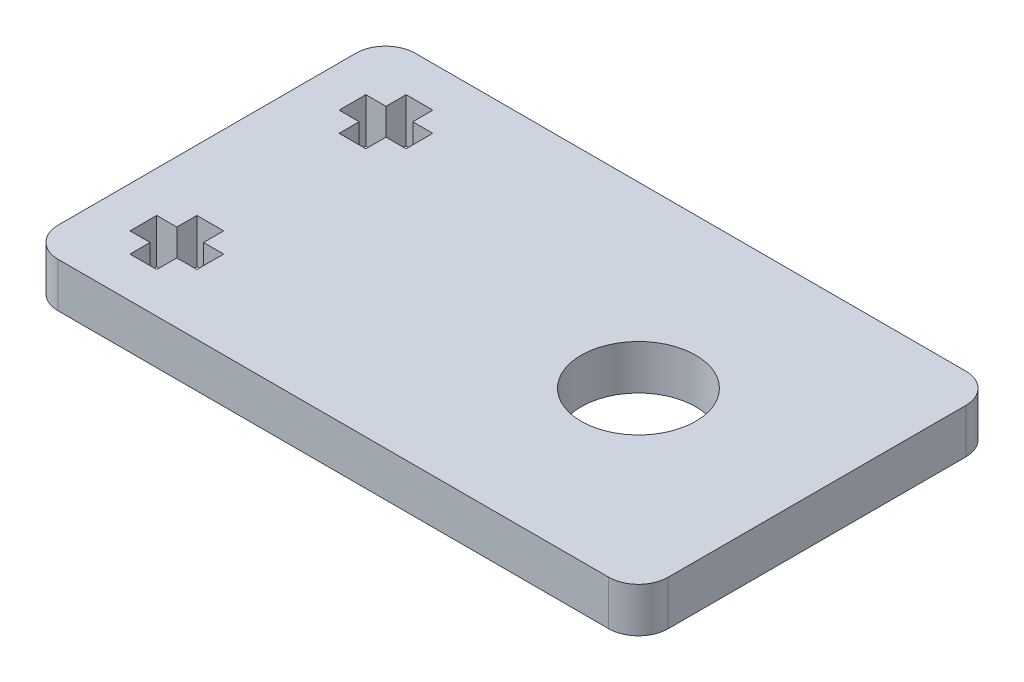
ISO-10303-21;
HEADER;
FILE_DESCRIPTION(('STEP AP214'),'2;1');
FILE_NAME('part.step','',(''),(''),'','','');
FILE_SCHEMA(('AUTOMOTIVE_DESIGN { 1 0 10303 214 1 1 1 1 }'));
ENDSEC;
DATA;
#1=APPLICATION_CONTEXT('core data for automotive mechanical design processes');
#2=APPLICATION_PROTOCOL_DEFINITION('international standard','automotive_design',2000,#1);
#3=PRODUCT_CONTEXT('',#1,'mechanical');
#4=PRODUCT('Part','Part','',(#3));
#5=PRODUCT_RELATED_PRODUCT_CATEGORY('part','',(#4));
#6=PRODUCT_DEFINITION_FORMATION('','',#4);
#7=PRODUCT_DEFINITION_CONTEXT('part definition',#1,'design');
#8=PRODUCT_DEFINITION('design','',#6,#7);
#9=PRODUCT_DEFINITION_SHAPE('','',#8);
#10=(LENGTH_UNIT() NAMED_UNIT(*) SI_UNIT(.MILLI.,.METRE.));
#11=(NAMED_UNIT(*) PLANE_ANGLE_UNIT() SI_UNIT($,.RADIAN.));
#12=(NAMED_UNIT(*) SI_UNIT($,.STERADIAN.) SOLID_ANGLE_UNIT());
#13=UNCERTAINTY_MEASURE_WITH_UNIT(LENGTH_MEASURE(1.E-05),#10,'distance_accuracy_value','');
#14=(GEOMETRIC_REPRESENTATION_CONTEXT(3) GLOBAL_UNCERTAINTY_ASSIGNED_CONTEXT((#13)) GLOBAL_UNIT_ASSIGNED_CONTEXT((#10,
#11,#12)) REPRESENTATION_CONTEXT('',''));
#15=CARTESIAN_POINT('',(0.,0.,0.));
#16=DIRECTION('',(0.,0.,1.));
#17=DIRECTION('',(1.,0.,0.));
#18=AXIS2_PLACEMENT_3D('',#15,#16,#17);
#19=CARTESIAN_POINT('',(0.,3.,0.));
#20=DIRECTION('',(0.,-1.,0.));
#21=DIRECTION('',(0.,0.,-1.));
#22=AXIS2_PLACEMENT_3D('',#19,#20,#21);
#23=PLANE('',#22);
#24=DIRECTION('',(0.,0.,-1.));
#25=VECTOR('',#24,1.);
#26=CARTESIAN_POINT('',(-21.75,3.,7.92943725152289));
#27=LINE('',#26,#25);
#28=CARTESIAN_POINT('',(-21.75,3.,7.92943725152289));
#29=VERTEX_POINT('',#28);
#30=CARTESIAN_POINT('',(-21.75,3.,6.12943725152289));
#31=VERTEX_POINT('',#30);
#32=EDGE_CURVE('E348',#29,#31,#27,.T.);
#33=ORIENTED_EDGE('',*,*,#32,.F.);
#34=DIRECTION('',(1.,0.,0.));
#35=VECTOR('',#34,1.);
#36=CARTESIAN_POINT('',(-23.1,3.,7.92943725152289));
#37=LINE('',#36,#35);
#38=CARTESIAN_POINT('',(-23.1,3.,7.92943725152289));
#39=VERTEX_POINT('',#38);
#40=EDGE_CURVE('E372',#39,#29,#37,.T.);
#41=ORIENTED_EDGE('',*,*,#40,.F.);
#42=DIRECTION('',(0.,0.,-1.));
#43=VECTOR('',#42,1.);
#44=CARTESIAN_POINT('',(-23.1,3.,9.27943725152289));
#45=LINE('',#44,#43);
#46=CARTESIAN_POINT('',(-23.1,3.,9.27943725152289));
#47=VERTEX_POINT('',#46);
#48=EDGE_CURVE('E369',#47,#39,#45,.T.);
#49=ORIENTED_EDGE('',*,*,#48,.F.);
#50=DIRECTION('',(1.,0.,0.));
#51=VECTOR('',#50,1.);
#52=CARTESIAN_POINT('',(-24.9,3.,9.27943725152289));
#53=LINE('',#52,#51);
#54=CARTESIAN_POINT('',(-24.9,3.,9.27943725152289));
#55=VERTEX_POINT('',#54);
#56=EDGE_CURVE('E367',#55,#47,#53,.T.);
#57=ORIENTED_EDGE('',*,*,#56,.F.);
#58=DIRECTION('',(0.,0.,1.));
#59=VECTOR('',#58,1.);
#60=CARTESIAN_POINT('',(-24.9,3.,7.92943725152289));
#61=LINE('',#60,#59);
#62=CARTESIAN_POINT('',(-24.9,3.,7.92943725152289));
#63=VERTEX_POINT('',#62);
#64=EDGE_CURVE('E365',#63,#55,#61,.T.);
#65=ORIENTED_EDGE('',*,*,#64,.F.);
#66=DIRECTION('',(1.,0.,0.));
#67=VECTOR('',#66,1.);
#68=CARTESIAN_POINT('',(-26.25,3.,7.92943725152289));
#69=LINE('',#68,#67);
#70=CARTESIAN_POINT('',(-26.25,3.,7.92943725152289));
#71=VERTEX_POINT('',#70);
#72=EDGE_CURVE('E363',#71,#63,#69,.T.);
#73=ORIENTED_EDGE('',*,*,#72,.F.);
#74=DIRECTION('',(0.,0.,1.));
#75=VECTOR('',#74,1.);
#76=CARTESIAN_POINT('',(-26.25,3.,6.12943725152289));
#77=LINE('',#76,#75);
#78=CARTESIAN_POINT('',(-26.25,3.,6.12943725152289));
#79=VERTEX_POINT('',#78);
#80=EDGE_CURVE('E361',#79,#71,#77,.T.);
#81=ORIENTED_EDGE('',*,*,#80,.F.);
#82=DIRECTION('',(-1.,0.,0.));
#83=VECTOR('',#82,1.);
#84=CARTESIAN_POINT('',(-24.9,3.,6.12943725152289));
#85=LINE('',#84,#83);
#86=CARTESIAN_POINT('',(-24.9,3.,6.12943725152289));
#87=VERTEX_POINT('',#86);
#88=EDGE_CURVE('E359',#87,#79,#85,.T.);
#89=ORIENTED_EDGE('',*,*,#88,.F.);
#90=DIRECTION('',(0.,0.,1.));
#91=VECTOR('',#90,1.);
#92=CARTESIAN_POINT('',(-24.9,3.,4.77943725152289));
#93=LINE('',#92,#91);
#94=CARTESIAN_POINT('',(-24.9,3.,4.77943725152289));
#95=VERTEX_POINT('',#94);
#96=EDGE_CURVE('E357',#95,#87,#93,.T.);
#97=ORIENTED_EDGE('',*,*,#96,.F.);
#98=DIRECTION('',(-1.,0.,0.));
#99=VECTOR('',#98,1.);
#100=CARTESIAN_POINT('',(-23.1,3.,4.77943725152289));
#101=LINE('',#100,#99);
#102=CARTESIAN_POINT('',(-23.1,3.,4.77943725152289));
#103=VERTEX_POINT('',#102);
#104=EDGE_CURVE('E355',#103,#95,#101,.T.);
#105=ORIENTED_EDGE('',*,*,#104,.F.);
#106=DIRECTION('',(0.,0.,-1.));
#107=VECTOR('',#106,1.);
#108=CARTESIAN_POINT('',(-23.1,3.,6.12943725152289));
#109=LINE('',#108,#107);
#110=CARTESIAN_POINT('',(-23.1,3.,6.12943725152289));
#111=VERTEX_POINT('',#110);
#112=EDGE_CURVE('E353',#111,#103,#109,.T.);
#113=ORIENTED_EDGE('',*,*,#112,.F.);
#114=DIRECTION('',(-1.,0.,0.));
#115=VECTOR('',#114,1.);
#116=CARTESIAN_POINT('',(-21.75,3.,6.12943725152289));
#117=LINE('',#116,#115);
#118=EDGE_CURVE('E350',#31,#111,#117,.T.);
#119=ORIENTED_EDGE('',*,*,#118,.F.);
#120=EDGE_LOOP('',(#33,#41,#49,#57,#65,#73,#81,#89,#97,#105,#113,#119));
#121=FACE_BOUND('',#120,.T.);
#122=DIRECTION('',(1.,0.,0.));
#123=VECTOR('',#122,1.);
#124=CARTESIAN_POINT('',(-29.,3.,12.));
#125=LINE('',#124,#123);
#126=CARTESIAN_POINT('',(-27.,3.,12.));
#127=VERTEX_POINT('',#126);
#128=CARTESIAN_POINT('',(9.99999999999999,3.,12.));
#129=VERTEX_POINT('',#128);
#130=EDGE_CURVE('E447',#127,#129,#125,.T.);
#131=ORIENTED_EDGE('',*,*,#130,.T.);
#132=CARTESIAN_POINT('',(10.,3.,10.));
#133=DIRECTION('',(0.,-1.,0.));
#134=DIRECTION('',(0.,0.,-1.));
#135=AXIS2_PLACEMENT_3D('',#132,#133,#134);
#136=CIRCLE('',#135,2.);
#137=CARTESIAN_POINT('',(12.,3.,10.));
#138=VERTEX_POINT('',#137);
#139=EDGE_CURVE('E481',#129,#138,#136,.F.);
#140=ORIENTED_EDGE('',*,*,#139,.T.);
#141=DIRECTION('',(0.,0.,1.));
#142=VECTOR('',#141,1.);
#143=CARTESIAN_POINT('',(12.,3.,21.6599183272156));
#144=LINE('',#143,#142);
#145=CARTESIAN_POINT('',(12.,3.,-10.));
#146=VERTEX_POINT('',#145);
#147=EDGE_CURVE('E503',#146,#138,#144,.T.);
#148=ORIENTED_EDGE('',*,*,#147,.F.);
#149=CARTESIAN_POINT('',(10.,3.,-10.));
#150=DIRECTION('',(0.,-1.,0.));
#151=DIRECTION('',(0.,0.,-1.));
#152=AXIS2_PLACEMENT_3D('',#149,#150,#151);
#153=CIRCLE('',#152,2.);
#154=CARTESIAN_POINT('',(9.99999999999999,3.,-12.));
#155=VERTEX_POINT('',#154);
#156=EDGE_CURVE('E479',#146,#155,#153,.F.);
#157=ORIENTED_EDGE('',*,*,#156,.T.);
#158=DIRECTION('',(-1.,0.,0.));
#159=VECTOR('',#158,1.);
#160=CARTESIAN_POINT('',(-29.,3.,-12.));
#161=LINE('',#160,#159);
#162=CARTESIAN_POINT('',(-27.,3.,-12.));
#163=VERTEX_POINT('',#162);
#164=EDGE_CURVE('E441',#155,#163,#161,.T.);
#165=ORIENTED_EDGE('',*,*,#164,.T.);
#166=CARTESIAN_POINT('',(-27.,3.,-10.));
#167=DIRECTION('',(0.,-1.,0.));
#168=DIRECTION('',(0.,0.,-1.));
#169=AXIS2_PLACEMENT_3D('',#166,#167,#168);
#170=CIRCLE('',#169,2.);
#171=CARTESIAN_POINT('',(-29.,3.,-10.));
#172=VERTEX_POINT('',#171);
#173=EDGE_CURVE('E464',#163,#172,#170,.F.);
#174=ORIENTED_EDGE('',*,*,#173,.T.);
#175=DIRECTION('',(0.,0.,1.));
#176=VECTOR('',#175,1.);
#177=CARTESIAN_POINT('',(-29.,3.,12.));
#178=LINE('',#177,#176);
#179=CARTESIAN_POINT('',(-29.,3.,10.));
#180=VERTEX_POINT('',#179);
#181=EDGE_CURVE('E443',#172,#180,#178,.T.);
#182=ORIENTED_EDGE('',*,*,#181,.T.);
#183=CARTESIAN_POINT('',(-27.,3.,10.));
#184=DIRECTION('',(0.,-1.,0.));
#185=DIRECTION('',(0.,0.,-1.));
#186=AXIS2_PLACEMENT_3D('',#183,#184,#185);
#187=CIRCLE('',#186,2.);
#188=EDGE_CURVE('E466',#180,#127,#187,.F.);
#189=ORIENTED_EDGE('',*,*,#188,.T.);
#190=EDGE_LOOP('',(#131,#140,#148,#157,#165,#174,#182,#189));
#191=FACE_BOUND('',#190,.T.);
#192=CARTESIAN_POINT('',(0.,3.,0.));
#193=DIRECTION('',(0.,1.,0.));
#194=DIRECTION('',(0.,0.,1.));
#195=AXIS2_PLACEMENT_3D('',#192,#193,#194);
#196=CIRCLE('',#195,3.85);
#197=CARTESIAN_POINT('',(0.,3.,3.85));
#198=VERTEX_POINT('',#197);
#199=EDGE_CURVE('E435',#198,#198,#196,.T.);
#200=ORIENTED_EDGE('',*,*,#199,.F.);
#201=EDGE_LOOP('',(#200));
#202=FACE_BOUND('',#201,.T.);
#203=DIRECTION('',(0.,0.,-1.));
#204=VECTOR('',#203,1.);
#205=CARTESIAN_POINT('',(-23.1,3.,-4.77943725152289));
#206=LINE('',#205,#204);
#207=CARTESIAN_POINT('',(-23.1,3.,-4.77943725152289));
#208=VERTEX_POINT('',#207);
#209=CARTESIAN_POINT('',(-23.1,3.,-6.12943725152289));
#210=VERTEX_POINT('',#209);
#211=EDGE_CURVE('E248',#208,#210,#206,.T.);
#212=ORIENTED_EDGE('',*,*,#211,.F.);
#213=DIRECTION('',(1.,0.,0.));
#214=VECTOR('',#213,1.);
#215=CARTESIAN_POINT('',(-24.9,3.,-4.77943725152289));
#216=LINE('',#215,#214);
#217=CARTESIAN_POINT('',(-24.9,3.,-4.77943725152289));
#218=VERTEX_POINT('',#217);
#219=EDGE_CURVE('E293',#218,#208,#216,.T.);
#220=ORIENTED_EDGE('',*,*,#219,.F.);
#221=DIRECTION('',(0.,0.,1.));
#222=VECTOR('',#221,1.);
#223=CARTESIAN_POINT('',(-24.9,3.,-6.12943725152289));
#224=LINE('',#223,#222);
#225=CARTESIAN_POINT('',(-24.9,3.,-6.12943725152289));
#226=VERTEX_POINT('',#225);
#227=EDGE_CURVE('E290',#226,#218,#224,.T.);
#228=ORIENTED_EDGE('',*,*,#227,.F.);
#229=DIRECTION('',(1.,0.,0.));
#230=VECTOR('',#229,1.);
#231=CARTESIAN_POINT('',(-26.25,3.,-6.12943725152289));
#232=LINE('',#231,#230);
#233=CARTESIAN_POINT('',(-26.25,3.,-6.12943725152289));
#234=VERTEX_POINT('',#233);
#235=EDGE_CURVE('E288',#234,#226,#232,.T.);
#236=ORIENTED_EDGE('',*,*,#235,.F.);
#237=DIRECTION('',(0.,0.,1.));
#238=VECTOR('',#237,1.);
#239=CARTESIAN_POINT('',(-26.25,3.,-7.92943725152289));
#240=LINE('',#239,#238);
#241=CARTESIAN_POINT('',(-26.25,3.,-7.92943725152289));
#242=VERTEX_POINT('',#241);
#243=EDGE_CURVE('E286',#242,#234,#240,.T.);
#244=ORIENTED_EDGE('',*,*,#243,.F.);
#245=DIRECTION('',(-1.,0.,0.));
#246=VECTOR('',#245,1.);
#247=CARTESIAN_POINT('',(-24.9,3.,-7.92943725152289));
#248=LINE('',#247,#246);
#249=CARTESIAN_POINT('',(-24.9,3.,-7.92943725152289));
#250=VERTEX_POINT('',#249);
#251=EDGE_CURVE('E284',#250,#242,#248,.T.);
#252=ORIENTED_EDGE('',*,*,#251,.F.);
#253=DIRECTION('',(0.,0.,1.));
#254=VECTOR('',#253,1.);
#255=CARTESIAN_POINT('',(-24.9,3.,-9.27943725152289));
#256=LINE('',#255,#254);
#257=CARTESIAN_POINT('',(-24.9,3.,-9.27943725152289));
#258=VERTEX_POINT('',#257);
#259=EDGE_CURVE('E282',#258,#250,#256,.T.);
#260=ORIENTED_EDGE('',*,*,#259,.F.);
#261=DIRECTION('',(-1.,0.,0.));
#262=VECTOR('',#261,1.);
#263=CARTESIAN_POINT('',(-23.1,3.,-9.27943725152289));
#264=LINE('',#263,#262);
#265=CARTESIAN_POINT('',(-23.1,3.,-9.27943725152289));
#266=VERTEX_POINT('',#265);
#267=EDGE_CURVE('E280',#266,#258,#264,.T.);
#268=ORIENTED_EDGE('',*,*,#267,.F.);
#269=DIRECTION('',(0.,0.,-1.));
#270=VECTOR('',#269,1.);
#271=CARTESIAN_POINT('',(-23.1,3.,-7.92943725152289));
#272=LINE('',#271,#270);
#273=CARTESIAN_POINT('',(-23.1,3.,-7.92943725152289));
#274=VERTEX_POINT('',#273);
#275=EDGE_CURVE('E278',#274,#266,#272,.T.);
#276=ORIENTED_EDGE('',*,*,#275,.F.);
#277=DIRECTION('',(-1.,0.,0.));
#278=VECTOR('',#277,1.);
#279=CARTESIAN_POINT('',(-21.75,3.,-7.92943725152289));
#280=LINE('',#279,#278);
#281=CARTESIAN_POINT('',(-21.75,3.,-7.92943725152289));
#282=VERTEX_POINT('',#281);
#283=EDGE_CURVE('E273',#282,#274,#280,.T.);
#284=ORIENTED_EDGE('',*,*,#283,.F.);
#285=DIRECTION('',(0.,0.,-1.));
#286=VECTOR('',#285,1.);
#287=CARTESIAN_POINT('',(-21.75,3.,-6.12943725152289));
#288=LINE('',#287,#286);
#289=CARTESIAN_POINT('',(-21.75,3.,-6.12943725152289));
#290=VERTEX_POINT('',#289);
#291=EDGE_CURVE('E271',#290,#282,#288,.T.);
#292=ORIENTED_EDGE('',*,*,#291,.F.);
#293=DIRECTION('',(1.,0.,0.));
#294=VECTOR('',#293,1.);
#295=CARTESIAN_POINT('',(-23.1,3.,-6.12943725152289));
#296=LINE('',#295,#294);
#297=EDGE_CURVE('E258',#210,#290,#296,.T.);
#298=ORIENTED_EDGE('',*,*,#297,.F.);
#299=EDGE_LOOP('',(#212,#220,#228,#236,#244,#252,#260,#268,#276,#284,#292,#298));
#300=FACE_BOUND('',#299,.T.);
#301=ADVANCED_FACE('F38',(#121,#191,#202,#300),#23,.F.);
#302=CARTESIAN_POINT('',(0.,0.,0.));
#303=DIRECTION('',(0.,-1.,0.));
#304=DIRECTION('',(0.,0.,-1.));
#305=AXIS2_PLACEMENT_3D('',#302,#303,#304);
#306=PLANE('',#305);
#307=DIRECTION('',(0.,0.,-1.));
#308=VECTOR('',#307,1.);
#309=CARTESIAN_POINT('',(12.,0.,0.));
#310=LINE('',#309,#308);
#311=CARTESIAN_POINT('',(12.,0.,10.));
#312=VERTEX_POINT('',#311);
#313=CARTESIAN_POINT('',(12.,0.,-10.));
#314=VERTEX_POINT('',#313);
#315=EDGE_CURVE('E297',#312,#314,#310,.T.);
#316=ORIENTED_EDGE('',*,*,#315,.F.);
#317=CARTESIAN_POINT('',(10.,0.,10.));
#318=DIRECTION('',(0.,-1.,0.));
#319=DIRECTION('',(0.,0.,-1.));
#320=AXIS2_PLACEMENT_3D('',#317,#318,#319);
#321=CIRCLE('',#320,2.);
#322=CARTESIAN_POINT('',(9.99999999999999,0.,12.));
#323=VERTEX_POINT('',#322);
#324=EDGE_CURVE('E46',#312,#323,#321,.T.);
#325=ORIENTED_EDGE('',*,*,#324,.T.);
#326=DIRECTION('',(1.,0.,0.));
#327=VECTOR('',#326,1.);
#328=CARTESIAN_POINT('',(-29.,0.,12.));
#329=LINE('',#328,#327);
#330=CARTESIAN_POINT('',(-27.,0.,12.));
#331=VERTEX_POINT('',#330);
#332=EDGE_CURVE('E444',#331,#323,#329,.T.);
#333=ORIENTED_EDGE('',*,*,#332,.F.);
#334=CARTESIAN_POINT('',(-27.,0.,10.));
#335=DIRECTION('',(0.,-1.,0.));
#336=DIRECTION('',(0.,0.,-1.));
#337=AXIS2_PLACEMENT_3D('',#334,#335,#336);
#338=CIRCLE('',#337,2.);
#339=CARTESIAN_POINT('',(-29.,0.,10.));
#340=VERTEX_POINT('',#339);
#341=EDGE_CURVE('E459',#331,#340,#338,.T.);
#342=ORIENTED_EDGE('',*,*,#341,.T.);
#343=DIRECTION('',(0.,0.,1.));
#344=VECTOR('',#343,1.);
#345=CARTESIAN_POINT('',(-29.,0.,12.));
#346=LINE('',#345,#344);
#347=CARTESIAN_POINT('',(-29.,0.,-10.));
#348=VERTEX_POINT('',#347);
#349=EDGE_CURVE('E452',#348,#340,#346,.T.);
#350=ORIENTED_EDGE('',*,*,#349,.F.);
#351=CARTESIAN_POINT('',(-27.,0.,-10.));
#352=DIRECTION('',(0.,-1.,0.));
#353=DIRECTION('',(0.,0.,-1.));
#354=AXIS2_PLACEMENT_3D('',#351,#352,#353);
#355=CIRCLE('',#354,2.);
#356=CARTESIAN_POINT('',(-27.,0.,-12.));
#357=VERTEX_POINT('',#356);
#358=EDGE_CURVE('E450',#348,#357,#355,.T.);
#359=ORIENTED_EDGE('',*,*,#358,.T.);
#360=DIRECTION('',(-1.,0.,0.));
#361=VECTOR('',#360,1.);
#362=CARTESIAN_POINT('',(-29.,0.,-12.));
#363=LINE('',#362,#361);
#364=CARTESIAN_POINT('',(9.99999999999999,0.,-12.));
#365=VERTEX_POINT('',#364);
#366=EDGE_CURVE('E438',#365,#357,#363,.T.);
#367=ORIENTED_EDGE('',*,*,#366,.F.);
#368=CARTESIAN_POINT('',(10.,0.,-10.));
#369=DIRECTION('',(0.,-1.,0.));
#370=DIRECTION('',(0.,0.,-1.));
#371=AXIS2_PLACEMENT_3D('',#368,#369,#370);
#372=CIRCLE('',#371,2.);
#373=EDGE_CURVE('E53',#365,#314,#372,.T.);
#374=ORIENTED_EDGE('',*,*,#373,.T.);
#375=EDGE_LOOP('',(#316,#325,#333,#342,#350,#359,#367,#374));
#376=FACE_BOUND('',#375,.T.);
#377=CARTESIAN_POINT('',(0.,0.,0.));
#378=DIRECTION('',(0.,1.,0.));
#379=DIRECTION('',(0.,0.,1.));
#380=AXIS2_PLACEMENT_3D('',#377,#378,#379);
#381=CIRCLE('',#380,3.85);
#382=CARTESIAN_POINT('',(0.,0.,3.85));
#383=VERTEX_POINT('',#382);
#384=EDGE_CURVE('E434',#383,#383,#381,.T.);
#385=ORIENTED_EDGE('',*,*,#384,.T.);
#386=EDGE_LOOP('',(#385));
#387=FACE_BOUND('',#386,.T.);
#388=DIRECTION('',(1.,0.,0.));
#389=VECTOR('',#388,1.);
#390=CARTESIAN_POINT('',(-23.1,0.,7.92943725152289));
#391=LINE('',#390,#389);
#392=CARTESIAN_POINT('',(-23.1,0.,7.92943725152289));
#393=VERTEX_POINT('',#392);
#394=CARTESIAN_POINT('',(-21.75,0.,7.92943725152289));
#395=VERTEX_POINT('',#394);
#396=EDGE_CURVE('E351',#393,#395,#391,.T.);
#397=ORIENTED_EDGE('',*,*,#396,.T.);
#398=DIRECTION('',(0.,0.,-1.));
#399=VECTOR('',#398,1.);
#400=CARTESIAN_POINT('',(-21.75,0.,7.92943725152289));
#401=LINE('',#400,#399);
#402=CARTESIAN_POINT('',(-21.75,0.,6.12943725152289));
#403=VERTEX_POINT('',#402);
#404=EDGE_CURVE('E266',#395,#403,#401,.T.);
#405=ORIENTED_EDGE('',*,*,#404,.T.);
#406=DIRECTION('',(-1.,0.,0.));
#407=VECTOR('',#406,1.);
#408=CARTESIAN_POINT('',(-21.75,0.,6.12943725152289));
#409=LINE('',#408,#407);
#410=CARTESIAN_POINT('',(-23.1,0.,6.12943725152289));
#411=VERTEX_POINT('',#410);
#412=EDGE_CURVE('E377',#403,#411,#409,.T.);
#413=ORIENTED_EDGE('',*,*,#412,.T.);
#414=DIRECTION('',(0.,0.,-1.));
#415=VECTOR('',#414,1.);
#416=CARTESIAN_POINT('',(-23.1,0.,6.12943725152289));
#417=LINE('',#416,#415);
#418=CARTESIAN_POINT('',(-23.1,0.,4.77943725152289));
#419=VERTEX_POINT('',#418);
#420=EDGE_CURVE('E380',#411,#419,#417,.T.);
#421=ORIENTED_EDGE('',*,*,#420,.T.);
#422=DIRECTION('',(-1.,0.,0.));
#423=VECTOR('',#422,1.);
#424=CARTESIAN_POINT('',(-23.1,0.,4.77943725152289));
#425=LINE('',#424,#423);
#426=CARTESIAN_POINT('',(-24.9,0.,4.77943725152289));
#427=VERTEX_POINT('',#426);
#428=EDGE_CURVE('E383',#419,#427,#425,.T.);
#429=ORIENTED_EDGE('',*,*,#428,.T.);
#430=DIRECTION('',(0.,0.,1.));
#431=VECTOR('',#430,1.);
#432=CARTESIAN_POINT('',(-24.9,0.,4.77943725152289));
#433=LINE('',#432,#431);
#434=CARTESIAN_POINT('',(-24.9,0.,6.12943725152289));
#435=VERTEX_POINT('',#434);
#436=EDGE_CURVE('E386',#427,#435,#433,.T.);
#437=ORIENTED_EDGE('',*,*,#436,.T.);
#438=DIRECTION('',(-1.,0.,0.));
#439=VECTOR('',#438,1.);
#440=CARTESIAN_POINT('',(-24.9,0.,6.12943725152289));
#441=LINE('',#440,#439);
#442=CARTESIAN_POINT('',(-26.25,0.,6.12943725152289));
#443=VERTEX_POINT('',#442);
#444=EDGE_CURVE('E389',#435,#443,#441,.T.);
#445=ORIENTED_EDGE('',*,*,#444,.T.);
#446=DIRECTION('',(0.,0.,1.));
#447=VECTOR('',#446,1.);
#448=CARTESIAN_POINT('',(-26.25,0.,6.12943725152289));
#449=LINE('',#448,#447);
#450=CARTESIAN_POINT('',(-26.25,0.,7.92943725152289));
#451=VERTEX_POINT('',#450);
#452=EDGE_CURVE('E392',#443,#451,#449,.T.);
#453=ORIENTED_EDGE('',*,*,#452,.T.);
#454=DIRECTION('',(1.,0.,0.));
#455=VECTOR('',#454,1.);
#456=CARTESIAN_POINT('',(-26.25,0.,7.92943725152289));
#457=LINE('',#456,#455);
#458=CARTESIAN_POINT('',(-24.9,0.,7.92943725152289));
#459=VERTEX_POINT('',#458);
#460=EDGE_CURVE('E395',#451,#459,#457,.T.);
#461=ORIENTED_EDGE('',*,*,#460,.T.);
#462=DIRECTION('',(0.,0.,1.));
#463=VECTOR('',#462,1.);
#464=CARTESIAN_POINT('',(-24.9,0.,7.92943725152289));
#465=LINE('',#464,#463);
#466=CARTESIAN_POINT('',(-24.9,0.,9.27943725152289));
#467=VERTEX_POINT('',#466);
#468=EDGE_CURVE('E398',#459,#467,#465,.T.);
#469=ORIENTED_EDGE('',*,*,#468,.T.);
#470=DIRECTION('',(1.,0.,0.));
#471=VECTOR('',#470,1.);
#472=CARTESIAN_POINT('',(-24.9,0.,9.27943725152289));
#473=LINE('',#472,#471);
#474=CARTESIAN_POINT('',(-23.1,0.,9.27943725152289));
#475=VERTEX_POINT('',#474);
#476=EDGE_CURVE('E401',#467,#475,#473,.T.);
#477=ORIENTED_EDGE('',*,*,#476,.T.);
#478=DIRECTION('',(0.,0.,-1.));
#479=VECTOR('',#478,1.);
#480=CARTESIAN_POINT('',(-23.1,0.,9.27943725152289));
#481=LINE('',#480,#479);
#482=EDGE_CURVE('E404',#475,#393,#481,.T.);
#483=ORIENTED_EDGE('',*,*,#482,.T.);
#484=EDGE_LOOP('',(#397,#405,#413,#421,#429,#437,#445,#453,#461,#469,#477,#483));
#485=FACE_BOUND('',#484,.T.);
#486=DIRECTION('',(1.,0.,0.));
#487=VECTOR('',#486,1.);
#488=CARTESIAN_POINT('',(-24.9,0.,-4.77943725152289));
#489=LINE('',#488,#487);
#490=CARTESIAN_POINT('',(-24.9,0.,-4.77943725152289));
#491=VERTEX_POINT('',#490);
#492=CARTESIAN_POINT('',(-23.1,0.,-4.77943725152289));
#493=VERTEX_POINT('',#492);
#494=EDGE_CURVE('E259',#491,#493,#489,.T.);
#495=ORIENTED_EDGE('',*,*,#494,.T.);
#496=DIRECTION('',(0.,0.,-1.));
#497=VECTOR('',#496,1.);
#498=CARTESIAN_POINT('',(-23.1,0.,-4.77943725152289));
#499=LINE('',#498,#497);
#500=CARTESIAN_POINT('',(-23.1,0.,-6.12943725152289));
#501=VERTEX_POINT('',#500);
#502=EDGE_CURVE('E295',#493,#501,#499,.T.);
#503=ORIENTED_EDGE('',*,*,#502,.T.);
#504=DIRECTION('',(1.,0.,0.));
#505=VECTOR('',#504,1.);
#506=CARTESIAN_POINT('',(-23.1,0.,-6.12943725152289));
#507=LINE('',#506,#505);
#508=CARTESIAN_POINT('',(-21.75,0.,-6.12943725152289));
#509=VERTEX_POINT('',#508);
#510=EDGE_CURVE('E265',#501,#509,#507,.T.);
#511=ORIENTED_EDGE('',*,*,#510,.T.);
#512=DIRECTION('',(0.,0.,-1.));
#513=VECTOR('',#512,1.);
#514=CARTESIAN_POINT('',(-21.75,0.,-6.12943725152289));
#515=LINE('',#514,#513);
#516=CARTESIAN_POINT('',(-21.75,0.,-7.92943725152289));
#517=VERTEX_POINT('',#516);
#518=EDGE_CURVE('E299',#509,#517,#515,.T.);
#519=ORIENTED_EDGE('',*,*,#518,.T.);
#520=DIRECTION('',(-1.,0.,0.));
#521=VECTOR('',#520,1.);
#522=CARTESIAN_POINT('',(-21.75,0.,-7.92943725152289));
#523=LINE('',#522,#521);
#524=CARTESIAN_POINT('',(-23.1,0.,-7.92943725152289));
#525=VERTEX_POINT('',#524);
#526=EDGE_CURVE('E302',#517,#525,#523,.T.);
#527=ORIENTED_EDGE('',*,*,#526,.T.);
#528=DIRECTION('',(0.,0.,-1.));
#529=VECTOR('',#528,1.);
#530=CARTESIAN_POINT('',(-23.1,0.,-7.92943725152289));
#531=LINE('',#530,#529);
#532=CARTESIAN_POINT('',(-23.1,0.,-9.27943725152289));
#533=VERTEX_POINT('',#532);
#534=EDGE_CURVE('E305',#525,#533,#531,.T.);
#535=ORIENTED_EDGE('',*,*,#534,.T.);
#536=DIRECTION('',(-1.,0.,0.));
#537=VECTOR('',#536,1.);
#538=CARTESIAN_POINT('',(-23.1,0.,-9.27943725152289));
#539=LINE('',#538,#537);
#540=CARTESIAN_POINT('',(-24.9,0.,-9.27943725152289));
#541=VERTEX_POINT('',#540);
#542=EDGE_CURVE('E308',#533,#541,#539,.T.);
#543=ORIENTED_EDGE('',*,*,#542,.T.);
#544=DIRECTION('',(0.,0.,1.));
#545=VECTOR('',#544,1.);
#546=CARTESIAN_POINT('',(-24.9,0.,-9.27943725152289));
#547=LINE('',#546,#545);
#548=CARTESIAN_POINT('',(-24.9,0.,-7.92943725152289));
#549=VERTEX_POINT('',#548);
#550=EDGE_CURVE('E311',#541,#549,#547,.T.);
#551=ORIENTED_EDGE('',*,*,#550,.T.);
#552=DIRECTION('',(-1.,0.,0.));
#553=VECTOR('',#552,1.);
#554=CARTESIAN_POINT('',(-24.9,0.,-7.92943725152289));
#555=LINE('',#554,#553);
#556=CARTESIAN_POINT('',(-26.25,0.,-7.92943725152289));
#557=VERTEX_POINT('',#556);
#558=EDGE_CURVE('E314',#549,#557,#555,.T.);
#559=ORIENTED_EDGE('',*,*,#558,.T.);
#560=DIRECTION('',(0.,0.,1.));
#561=VECTOR('',#560,1.);
#562=CARTESIAN_POINT('',(-26.25,0.,-7.92943725152289));
#563=LINE('',#562,#561);
#564=CARTESIAN_POINT('',(-26.25,0.,-6.12943725152289));
#565=VERTEX_POINT('',#564);
#566=EDGE_CURVE('E317',#557,#565,#563,.T.);
#567=ORIENTED_EDGE('',*,*,#566,.T.);
#568=DIRECTION('',(1.,0.,0.));
#569=VECTOR('',#568,1.);
#570=CARTESIAN_POINT('',(-26.25,0.,-6.12943725152289));
#571=LINE('',#570,#569);
#572=CARTESIAN_POINT('',(-24.9,0.,-6.12943725152289));
#573=VERTEX_POINT('',#572);
#574=EDGE_CURVE('E320',#565,#573,#571,.T.);
#575=ORIENTED_EDGE('',*,*,#574,.T.);
#576=DIRECTION('',(0.,0.,1.));
#577=VECTOR('',#576,1.);
#578=CARTESIAN_POINT('',(-24.9,0.,-6.12943725152289));
#579=LINE('',#578,#577);
#580=EDGE_CURVE('E323',#573,#491,#579,.T.);
#581=ORIENTED_EDGE('',*,*,#580,.T.);
#582=EDGE_LOOP('',(#495,#503,#511,#519,#527,#535,#543,#551,#559,#567,#575,#581));
#583=FACE_BOUND('',#582,.T.);
#584=ADVANCED_FACE('F489',(#376,#387,#485,#583),#306,.T.);
#585=CARTESIAN_POINT('',(-29.,3.,-12.));
#586=DIRECTION('',(0.,0.,1.));
#587=DIRECTION('',(1.,0.,0.));
#588=AXIS2_PLACEMENT_3D('',#585,#586,#587);
#589=PLANE('',#588);
#590=ORIENTED_EDGE('',*,*,#164,.F.);
#591=DIRECTION('',(0.,-1.,0.));
#592=VECTOR('',#591,1.);
#593=CARTESIAN_POINT('',(10.,3.,-12.));
#594=LINE('',#593,#592);
#595=EDGE_CURVE('E11',#155,#365,#594,.T.);
#596=ORIENTED_EDGE('',*,*,#595,.T.);
#597=ORIENTED_EDGE('',*,*,#366,.T.);
#598=DIRECTION('',(0.,-1.,0.));
#599=VECTOR('',#598,1.);
#600=CARTESIAN_POINT('',(-27.,3.,-12.));
#601=LINE('',#600,#599);
#602=EDGE_CURVE('E468',#357,#163,#601,.F.);
#603=ORIENTED_EDGE('',*,*,#602,.T.);
#604=EDGE_LOOP('',(#590,#596,#597,#603));
#605=FACE_BOUND('',#604,.T.);
#606=ADVANCED_FACE('F510',(#605),#589,.F.);
#607=CARTESIAN_POINT('',(-29.,3.,12.));
#608=DIRECTION('',(1.,0.,0.));
#609=DIRECTION('',(0.,0.,-1.));
#610=AXIS2_PLACEMENT_3D('',#607,#608,#609);
#611=PLANE('',#610);
#612=ORIENTED_EDGE('',*,*,#349,.T.);
#613=DIRECTION('',(0.,-1.,0.));
#614=VECTOR('',#613,1.);
#615=CARTESIAN_POINT('',(-29.,3.,10.));
#616=LINE('',#615,#614);
#617=EDGE_CURVE('E474',#340,#180,#616,.F.);
#618=ORIENTED_EDGE('',*,*,#617,.T.);
#619=ORIENTED_EDGE('',*,*,#181,.F.);
#620=DIRECTION('',(0.,-1.,0.));
#621=VECTOR('',#620,1.);
#622=CARTESIAN_POINT('',(-29.,3.,-10.));
#623=LINE('',#622,#621);
#624=EDGE_CURVE('E471',#172,#348,#623,.T.);
#625=ORIENTED_EDGE('',*,*,#624,.T.);
#626=EDGE_LOOP('',(#612,#618,#619,#625));
#627=FACE_BOUND('',#626,.T.);
#628=ADVANCED_FACE('F519',(#627),#611,.F.);
#629=CARTESIAN_POINT('',(-29.,3.,12.));
#630=DIRECTION('',(0.,0.,-1.));
#631=DIRECTION('',(-1.,0.,0.));
#632=AXIS2_PLACEMENT_3D('',#629,#630,#631);
#633=PLANE('',#632);
#634=ORIENTED_EDGE('',*,*,#332,.T.);
#635=DIRECTION('',(0.,1.,0.));
#636=VECTOR('',#635,1.);
#637=CARTESIAN_POINT('',(10.,3.,12.));
#638=LINE('',#637,#636);
#639=EDGE_CURVE('E476',#323,#129,#638,.T.);
#640=ORIENTED_EDGE('',*,*,#639,.T.);
#641=ORIENTED_EDGE('',*,*,#130,.F.);
#642=DIRECTION('',(0.,-1.,0.));
#643=VECTOR('',#642,1.);
#644=CARTESIAN_POINT('',(-27.,3.,12.));
#645=LINE('',#644,#643);
#646=EDGE_CURVE('E461',#127,#331,#645,.T.);
#647=ORIENTED_EDGE('',*,*,#646,.T.);
#648=EDGE_LOOP('',(#634,#640,#641,#647));
#649=FACE_BOUND('',#648,.T.);
#650=ADVANCED_FACE('F495',(#649),#633,.F.);
#651=CARTESIAN_POINT('',(0.,3.,0.));
#652=DIRECTION('',(0.,-1.,0.));
#653=DIRECTION('',(0.,0.,-1.));
#654=AXIS2_PLACEMENT_3D('',#651,#652,#653);
#655=CYLINDRICAL_SURFACE('',#654,3.85);
#656=ORIENTED_EDGE('',*,*,#199,.T.);
#657=EDGE_LOOP('',(#656));
#658=FACE_BOUND('',#657,.T.);
#659=ORIENTED_EDGE('',*,*,#384,.F.);
#660=EDGE_LOOP('',(#659));
#661=FACE_BOUND('',#660,.T.);
#662=ADVANCED_FACE('F546',(#658,#661),#655,.F.);
#663=CARTESIAN_POINT('',(-21.75,3.,7.92943725152289));
#664=DIRECTION('',(-1.,0.,0.));
#665=DIRECTION('',(0.,0.,1.));
#666=AXIS2_PLACEMENT_3D('',#663,#664,#665);
#667=PLANE('',#666);
#668=ORIENTED_EDGE('',*,*,#404,.F.);
#669=DIRECTION('',(0.,-1.,0.));
#670=VECTOR('',#669,1.);
#671=CARTESIAN_POINT('',(-21.75,3.,7.92943725152289));
#672=LINE('',#671,#670);
#673=EDGE_CURVE('E374',#29,#395,#672,.T.);
#674=ORIENTED_EDGE('',*,*,#673,.F.);
#675=ORIENTED_EDGE('',*,*,#32,.T.);
#676=DIRECTION('',(0.,-1.,0.));
#677=VECTOR('',#676,1.);
#678=CARTESIAN_POINT('',(-21.75,3.,6.12943725152289));
#679=LINE('',#678,#677);
#680=EDGE_CURVE('E431',#31,#403,#679,.T.);
#681=ORIENTED_EDGE('',*,*,#680,.T.);
#682=EDGE_LOOP('',(#668,#674,#675,#681));
#683=FACE_BOUND('',#682,.T.);
#684=ADVANCED_FACE('F792',(#683),#667,.T.);
#685=CARTESIAN_POINT('',(-21.75,3.,6.12943725152289));
#686=DIRECTION('',(0.,0.,1.));
#687=DIRECTION('',(1.,0.,0.));
#688=AXIS2_PLACEMENT_3D('',#685,#686,#687);
#689=PLANE('',#688);
#690=ORIENTED_EDGE('',*,*,#412,.F.);
#691=ORIENTED_EDGE('',*,*,#680,.F.);
#692=ORIENTED_EDGE('',*,*,#118,.T.);
#693=DIRECTION('',(0.,-1.,0.));
#694=VECTOR('',#693,1.);
#695=CARTESIAN_POINT('',(-23.1,3.,6.12943725152289));
#696=LINE('',#695,#694);
#697=EDGE_CURVE('E429',#111,#411,#696,.T.);
#698=ORIENTED_EDGE('',*,*,#697,.T.);
#699=EDGE_LOOP('',(#690,#691,#692,#698));
#700=FACE_BOUND('',#699,.T.);
#701=ADVANCED_FACE('F783',(#700),#689,.T.);
#702=CARTESIAN_POINT('',(-23.1,3.,6.12943725152289));
#703=DIRECTION('',(-1.,0.,0.));
#704=DIRECTION('',(0.,0.,1.));
#705=AXIS2_PLACEMENT_3D('',#702,#703,#704);
#706=PLANE('',#705);
#707=ORIENTED_EDGE('',*,*,#420,.F.);
#708=ORIENTED_EDGE('',*,*,#697,.F.);
#709=ORIENTED_EDGE('',*,*,#112,.T.);
#710=DIRECTION('',(0.,-1.,0.));
#711=VECTOR('',#710,1.);
#712=CARTESIAN_POINT('',(-23.1,3.,4.77943725152289));
#713=LINE('',#712,#711);
#714=EDGE_CURVE('E427',#103,#419,#713,.T.);
#715=ORIENTED_EDGE('',*,*,#714,.T.);
#716=EDGE_LOOP('',(#707,#708,#709,#715));
#717=FACE_BOUND('',#716,.T.);
#718=ADVANCED_FACE('F774',(#717),#706,.T.);
#719=CARTESIAN_POINT('',(-23.1,3.,4.77943725152289));
#720=DIRECTION('',(0.,0.,1.));
#721=DIRECTION('',(1.,0.,0.));
#722=AXIS2_PLACEMENT_3D('',#719,#720,#721);
#723=PLANE('',#722);
#724=ORIENTED_EDGE('',*,*,#428,.F.);
#725=ORIENTED_EDGE('',*,*,#714,.F.);
#726=ORIENTED_EDGE('',*,*,#104,.T.);
#727=DIRECTION('',(0.,-1.,0.));
#728=VECTOR('',#727,1.);
#729=CARTESIAN_POINT('',(-24.9,3.,4.77943725152289));
#730=LINE('',#729,#728);
#731=EDGE_CURVE('E425',#95,#427,#730,.T.);
#732=ORIENTED_EDGE('',*,*,#731,.T.);
#733=EDGE_LOOP('',(#724,#725,#726,#732));
#734=FACE_BOUND('',#733,.T.);
#735=ADVANCED_FACE('F765',(#734),#723,.T.);
#736=CARTESIAN_POINT('',(-24.9,3.,4.77943725152289));
#737=DIRECTION('',(1.,0.,0.));
#738=DIRECTION('',(0.,0.,-1.));
#739=AXIS2_PLACEMENT_3D('',#736,#737,#738);
#740=PLANE('',#739);
#741=ORIENTED_EDGE('',*,*,#436,.F.);
#742=ORIENTED_EDGE('',*,*,#731,.F.);
#743=ORIENTED_EDGE('',*,*,#96,.T.);
#744=DIRECTION('',(0.,-1.,0.));
#745=VECTOR('',#744,1.);
#746=CARTESIAN_POINT('',(-24.9,3.,6.12943725152289));
#747=LINE('',#746,#745);
#748=EDGE_CURVE('E423',#87,#435,#747,.T.);
#749=ORIENTED_EDGE('',*,*,#748,.T.);
#750=EDGE_LOOP('',(#741,#742,#743,#749));
#751=FACE_BOUND('',#750,.T.);
#752=ADVANCED_FACE('F756',(#751),#740,.T.);
#753=CARTESIAN_POINT('',(-24.9,3.,6.12943725152289));
#754=DIRECTION('',(0.,0.,1.));
#755=DIRECTION('',(1.,0.,0.));
#756=AXIS2_PLACEMENT_3D('',#753,#754,#755);
#757=PLANE('',#756);
#758=ORIENTED_EDGE('',*,*,#444,.F.);
#759=ORIENTED_EDGE('',*,*,#748,.F.);
#760=ORIENTED_EDGE('',*,*,#88,.T.);
#761=DIRECTION('',(0.,-1.,0.));
#762=VECTOR('',#761,1.);
#763=CARTESIAN_POINT('',(-26.25,3.,6.12943725152289));
#764=LINE('',#763,#762);
#765=EDGE_CURVE('E421',#79,#443,#764,.T.);
#766=ORIENTED_EDGE('',*,*,#765,.T.);
#767=EDGE_LOOP('',(#758,#759,#760,#766));
#768=FACE_BOUND('',#767,.T.);
#769=ADVANCED_FACE('F747',(#768),#757,.T.);
#770=CARTESIAN_POINT('',(-26.25,3.,6.12943725152289));
#771=DIRECTION('',(1.,0.,0.));
#772=DIRECTION('',(0.,0.,-1.));
#773=AXIS2_PLACEMENT_3D('',#770,#771,#772);
#774=PLANE('',#773);
#775=ORIENTED_EDGE('',*,*,#452,.F.);
#776=ORIENTED_EDGE('',*,*,#765,.F.);
#777=ORIENTED_EDGE('',*,*,#80,.T.);
#778=DIRECTION('',(0.,-1.,0.));
#779=VECTOR('',#778,1.);
#780=CARTESIAN_POINT('',(-26.25,3.,7.92943725152289));
#781=LINE('',#780,#779);
#782=EDGE_CURVE('E419',#71,#451,#781,.T.);
#783=ORIENTED_EDGE('',*,*,#782,.T.);
#784=EDGE_LOOP('',(#775,#776,#777,#783));
#785=FACE_BOUND('',#784,.T.);
#786=ADVANCED_FACE('F738',(#785),#774,.T.);
#787=CARTESIAN_POINT('',(-26.25,3.,7.92943725152289));
#788=DIRECTION('',(0.,0.,-1.));
#789=DIRECTION('',(-1.,0.,0.));
#790=AXIS2_PLACEMENT_3D('',#787,#788,#789);
#791=PLANE('',#790);
#792=ORIENTED_EDGE('',*,*,#460,.F.);
#793=ORIENTED_EDGE('',*,*,#782,.F.);
#794=ORIENTED_EDGE('',*,*,#72,.T.);
#795=DIRECTION('',(0.,-1.,0.));
#796=VECTOR('',#795,1.);
#797=CARTESIAN_POINT('',(-24.9,3.,7.92943725152289));
#798=LINE('',#797,#796);
#799=EDGE_CURVE('E417',#63,#459,#798,.T.);
#800=ORIENTED_EDGE('',*,*,#799,.T.);
#801=EDGE_LOOP('',(#792,#793,#794,#800));
#802=FACE_BOUND('',#801,.T.);
#803=ADVANCED_FACE('F729',(#802),#791,.T.);
#804=CARTESIAN_POINT('',(-24.9,3.,7.92943725152289));
#805=DIRECTION('',(1.,0.,0.));
#806=DIRECTION('',(0.,0.,-1.));
#807=AXIS2_PLACEMENT_3D('',#804,#805,#806);
#808=PLANE('',#807);
#809=ORIENTED_EDGE('',*,*,#468,.F.);
#810=ORIENTED_EDGE('',*,*,#799,.F.);
#811=ORIENTED_EDGE('',*,*,#64,.T.);
#812=DIRECTION('',(0.,-1.,0.));
#813=VECTOR('',#812,1.);
#814=CARTESIAN_POINT('',(-24.9,3.,9.27943725152289));
#815=LINE('',#814,#813);
#816=EDGE_CURVE('E415',#55,#467,#815,.T.);
#817=ORIENTED_EDGE('',*,*,#816,.T.);
#818=EDGE_LOOP('',(#809,#810,#811,#817));
#819=FACE_BOUND('',#818,.T.);
#820=ADVANCED_FACE('F720',(#819),#808,.T.);
#821=CARTESIAN_POINT('',(-24.9,3.,9.27943725152289));
#822=DIRECTION('',(0.,0.,-1.));
#823=DIRECTION('',(-1.,0.,0.));
#824=AXIS2_PLACEMENT_3D('',#821,#822,#823);
#825=PLANE('',#824);
#826=ORIENTED_EDGE('',*,*,#476,.F.);
#827=ORIENTED_EDGE('',*,*,#816,.F.);
#828=ORIENTED_EDGE('',*,*,#56,.T.);
#829=DIRECTION('',(0.,-1.,0.));
#830=VECTOR('',#829,1.);
#831=CARTESIAN_POINT('',(-23.1,3.,9.27943725152289));
#832=LINE('',#831,#830);
#833=EDGE_CURVE('E413',#47,#475,#832,.T.);
#834=ORIENTED_EDGE('',*,*,#833,.T.);
#835=EDGE_LOOP('',(#826,#827,#828,#834));
#836=FACE_BOUND('',#835,.T.);
#837=ADVANCED_FACE('F711',(#836),#825,.T.);
#838=CARTESIAN_POINT('',(-23.1,3.,9.27943725152289));
#839=DIRECTION('',(-1.,0.,0.));
#840=DIRECTION('',(0.,0.,1.));
#841=AXIS2_PLACEMENT_3D('',#838,#839,#840);
#842=PLANE('',#841);
#843=ORIENTED_EDGE('',*,*,#482,.F.);
#844=ORIENTED_EDGE('',*,*,#833,.F.);
#845=ORIENTED_EDGE('',*,*,#48,.T.);
#846=DIRECTION('',(0.,-1.,0.));
#847=VECTOR('',#846,1.);
#848=CARTESIAN_POINT('',(-23.1,3.,7.92943725152289));
#849=LINE('',#848,#847);
#850=EDGE_CURVE('E411',#39,#393,#849,.T.);
#851=ORIENTED_EDGE('',*,*,#850,.T.);
#852=EDGE_LOOP('',(#843,#844,#845,#851));
#853=FACE_BOUND('',#852,.T.);
#854=ADVANCED_FACE('F702',(#853),#842,.T.);
#855=CARTESIAN_POINT('',(-23.1,3.,7.92943725152289));
#856=DIRECTION('',(0.,0.,-1.));
#857=DIRECTION('',(-1.,0.,0.));
#858=AXIS2_PLACEMENT_3D('',#855,#856,#857);
#859=PLANE('',#858);
#860=ORIENTED_EDGE('',*,*,#396,.F.);
#861=ORIENTED_EDGE('',*,*,#850,.F.);
#862=ORIENTED_EDGE('',*,*,#40,.T.);
#863=ORIENTED_EDGE('',*,*,#673,.T.);
#864=EDGE_LOOP('',(#860,#861,#862,#863));
#865=FACE_BOUND('',#864,.T.);
#866=ADVANCED_FACE('F694',(#865),#859,.T.);
#867=CARTESIAN_POINT('',(-23.1,3.,-4.77943725152289));
#868=DIRECTION('',(-1.,0.,0.));
#869=DIRECTION('',(0.,0.,1.));
#870=AXIS2_PLACEMENT_3D('',#867,#868,#869);
#871=PLANE('',#870);
#872=ORIENTED_EDGE('',*,*,#502,.F.);
#873=DIRECTION('',(0.,-1.,0.));
#874=VECTOR('',#873,1.);
#875=CARTESIAN_POINT('',(-23.1,3.,-4.77943725152289));
#876=LINE('',#875,#874);
#877=EDGE_CURVE('E254',#208,#493,#876,.T.);
#878=ORIENTED_EDGE('',*,*,#877,.F.);
#879=ORIENTED_EDGE('',*,*,#211,.T.);
#880=DIRECTION('',(0.,-1.,0.));
#881=VECTOR('',#880,1.);
#882=CARTESIAN_POINT('',(-23.1,3.,-6.12943725152289));
#883=LINE('',#882,#881);
#884=EDGE_CURVE('E251',#210,#501,#883,.T.);
#885=ORIENTED_EDGE('',*,*,#884,.T.);
#886=EDGE_LOOP('',(#872,#878,#879,#885));
#887=FACE_BOUND('',#886,.T.);
#888=ADVANCED_FACE('F250',(#887),#871,.T.);
#889=CARTESIAN_POINT('',(-23.1,3.,-6.12943725152289));
#890=DIRECTION('',(0.,0.,-1.));
#891=DIRECTION('',(-1.,0.,0.));
#892=AXIS2_PLACEMENT_3D('',#889,#890,#891);
#893=PLANE('',#892);
#894=ORIENTED_EDGE('',*,*,#510,.F.);
#895=ORIENTED_EDGE('',*,*,#884,.F.);
#896=ORIENTED_EDGE('',*,*,#297,.T.);
#897=DIRECTION('',(0.,-1.,0.));
#898=VECTOR('',#897,1.);
#899=CARTESIAN_POINT('',(-21.75,3.,-6.12943725152289));
#900=LINE('',#899,#898);
#901=EDGE_CURVE('E267',#290,#509,#900,.T.);
#902=ORIENTED_EDGE('',*,*,#901,.T.);
#903=EDGE_LOOP('',(#894,#895,#896,#902));
#904=FACE_BOUND('',#903,.T.);
#905=ADVANCED_FACE('F262',(#904),#893,.T.);
#906=CARTESIAN_POINT('',(-21.75,3.,-6.12943725152289));
#907=DIRECTION('',(-1.,0.,0.));
#908=DIRECTION('',(0.,0.,1.));
#909=AXIS2_PLACEMENT_3D('',#906,#907,#908);
#910=PLANE('',#909);
#911=ORIENTED_EDGE('',*,*,#518,.F.);
#912=ORIENTED_EDGE('',*,*,#901,.F.);
#913=ORIENTED_EDGE('',*,*,#291,.T.);
#914=DIRECTION('',(0.,-1.,0.));
#915=VECTOR('',#914,1.);
#916=CARTESIAN_POINT('',(-21.75,3.,-7.92943725152289));
#917=LINE('',#916,#915);
#918=EDGE_CURVE('E345',#282,#517,#917,.T.);
#919=ORIENTED_EDGE('',*,*,#918,.T.);
#920=EDGE_LOOP('',(#911,#912,#913,#919));
#921=FACE_BOUND('',#920,.T.);
#922=ADVANCED_FACE('F670',(#921),#910,.T.);
#923=CARTESIAN_POINT('',(-21.75,3.,-7.92943725152289));
#924=DIRECTION('',(0.,0.,1.));
#925=DIRECTION('',(1.,0.,0.));
#926=AXIS2_PLACEMENT_3D('',#923,#924,#925);
#927=PLANE('',#926);
#928=ORIENTED_EDGE('',*,*,#526,.F.);
#929=ORIENTED_EDGE('',*,*,#918,.F.);
#930=ORIENTED_EDGE('',*,*,#283,.T.);
#931=DIRECTION('',(0.,-1.,0.));
#932=VECTOR('',#931,1.);
#933=CARTESIAN_POINT('',(-23.1,3.,-7.92943725152289));
#934=LINE('',#933,#932);
#935=EDGE_CURVE('E343',#274,#525,#934,.T.);
#936=ORIENTED_EDGE('',*,*,#935,.T.);
#937=EDGE_LOOP('',(#928,#929,#930,#936));
#938=FACE_BOUND('',#937,.T.);
#939=ADVANCED_FACE('F661',(#938),#927,.T.);
#940=CARTESIAN_POINT('',(-23.1,3.,-7.92943725152289));
#941=DIRECTION('',(-1.,0.,0.));
#942=DIRECTION('',(0.,0.,1.));
#943=AXIS2_PLACEMENT_3D('',#940,#941,#942);
#944=PLANE('',#943);
#945=ORIENTED_EDGE('',*,*,#534,.F.);
#946=ORIENTED_EDGE('',*,*,#935,.F.);
#947=ORIENTED_EDGE('',*,*,#275,.T.);
#948=DIRECTION('',(0.,-1.,0.));
#949=VECTOR('',#948,1.);
#950=CARTESIAN_POINT('',(-23.1,3.,-9.27943725152289));
#951=LINE('',#950,#949);
#952=EDGE_CURVE('E341',#266,#533,#951,.T.);
#953=ORIENTED_EDGE('',*,*,#952,.T.);
#954=EDGE_LOOP('',(#945,#946,#947,#953));
#955=FACE_BOUND('',#954,.T.);
#956=ADVANCED_FACE('F652',(#955),#944,.T.);
#957=CARTESIAN_POINT('',(-23.1,3.,-9.27943725152289));
#958=DIRECTION('',(0.,0.,1.));
#959=DIRECTION('',(1.,0.,0.));
#960=AXIS2_PLACEMENT_3D('',#957,#958,#959);
#961=PLANE('',#960);
#962=ORIENTED_EDGE('',*,*,#542,.F.);
#963=ORIENTED_EDGE('',*,*,#952,.F.);
#964=ORIENTED_EDGE('',*,*,#267,.T.);
#965=DIRECTION('',(0.,-1.,0.));
#966=VECTOR('',#965,1.);
#967=CARTESIAN_POINT('',(-24.9,3.,-9.27943725152289));
#968=LINE('',#967,#966);
#969=EDGE_CURVE('E339',#258,#541,#968,.T.);
#970=ORIENTED_EDGE('',*,*,#969,.T.);
#971=EDGE_LOOP('',(#962,#963,#964,#970));
#972=FACE_BOUND('',#971,.T.);
#973=ADVANCED_FACE('F643',(#972),#961,.T.);
#974=CARTESIAN_POINT('',(-24.9,3.,-9.27943725152289));
#975=DIRECTION('',(1.,0.,0.));
#976=DIRECTION('',(0.,0.,-1.));
#977=AXIS2_PLACEMENT_3D('',#974,#975,#976);
#978=PLANE('',#977);
#979=ORIENTED_EDGE('',*,*,#550,.F.);
#980=ORIENTED_EDGE('',*,*,#969,.F.);
#981=ORIENTED_EDGE('',*,*,#259,.T.);
#982=DIRECTION('',(0.,-1.,0.));
#983=VECTOR('',#982,1.);
#984=CARTESIAN_POINT('',(-24.9,3.,-7.92943725152289));
#985=LINE('',#984,#983);
#986=EDGE_CURVE('E337',#250,#549,#985,.T.);
#987=ORIENTED_EDGE('',*,*,#986,.T.);
#988=EDGE_LOOP('',(#979,#980,#981,#987));
#989=FACE_BOUND('',#988,.T.);
#990=ADVANCED_FACE('F634',(#989),#978,.T.);
#991=CARTESIAN_POINT('',(-24.9,3.,-7.92943725152289));
#992=DIRECTION('',(0.,0.,1.));
#993=DIRECTION('',(1.,0.,0.));
#994=AXIS2_PLACEMENT_3D('',#991,#992,#993);
#995=PLANE('',#994);
#996=ORIENTED_EDGE('',*,*,#558,.F.);
#997=ORIENTED_EDGE('',*,*,#986,.F.);
#998=ORIENTED_EDGE('',*,*,#251,.T.);
#999=DIRECTION('',(0.,-1.,0.));
#1000=VECTOR('',#999,1.);
#1001=CARTESIAN_POINT('',(-26.25,3.,-7.92943725152289));
#1002=LINE('',#1001,#1000);
#1003=EDGE_CURVE('E335',#242,#557,#1002,.T.);
#1004=ORIENTED_EDGE('',*,*,#1003,.T.);
#1005=EDGE_LOOP('',(#996,#997,#998,#1004));
#1006=FACE_BOUND('',#1005,.T.);
#1007=ADVANCED_FACE('F625',(#1006),#995,.T.);
#1008=CARTESIAN_POINT('',(-26.25,3.,-7.92943725152289));
#1009=DIRECTION('',(1.,0.,0.));
#1010=DIRECTION('',(0.,0.,-1.));
#1011=AXIS2_PLACEMENT_3D('',#1008,#1009,#1010);
#1012=PLANE('',#1011);
#1013=ORIENTED_EDGE('',*,*,#566,.F.);
#1014=ORIENTED_EDGE('',*,*,#1003,.F.);
#1015=ORIENTED_EDGE('',*,*,#243,.T.);
#1016=DIRECTION('',(0.,-1.,0.));
#1017=VECTOR('',#1016,1.);
#1018=CARTESIAN_POINT('',(-26.25,3.,-6.12943725152289));
#1019=LINE('',#1018,#1017);
#1020=EDGE_CURVE('E333',#234,#565,#1019,.T.);
#1021=ORIENTED_EDGE('',*,*,#1020,.T.);
#1022=EDGE_LOOP('',(#1013,#1014,#1015,#1021));
#1023=FACE_BOUND('',#1022,.T.);
#1024=ADVANCED_FACE('F616',(#1023),#1012,.T.);
#1025=CARTESIAN_POINT('',(-26.25,3.,-6.12943725152289));
#1026=DIRECTION('',(0.,0.,-1.));
#1027=DIRECTION('',(-1.,0.,0.));
#1028=AXIS2_PLACEMENT_3D('',#1025,#1026,#1027);
#1029=PLANE('',#1028);
#1030=ORIENTED_EDGE('',*,*,#574,.F.);
#1031=ORIENTED_EDGE('',*,*,#1020,.F.);
#1032=ORIENTED_EDGE('',*,*,#235,.T.);
#1033=DIRECTION('',(0.,-1.,0.));
#1034=VECTOR('',#1033,1.);
#1035=CARTESIAN_POINT('',(-24.9,3.,-6.12943725152289));
#1036=LINE('',#1035,#1034);
#1037=EDGE_CURVE('E331',#226,#573,#1036,.T.);
#1038=ORIENTED_EDGE('',*,*,#1037,.T.);
#1039=EDGE_LOOP('',(#1030,#1031,#1032,#1038));
#1040=FACE_BOUND('',#1039,.T.);
#1041=ADVANCED_FACE('F607',(#1040),#1029,.T.);
#1042=CARTESIAN_POINT('',(-24.9,3.,-6.12943725152289));
#1043=DIRECTION('',(1.,0.,0.));
#1044=DIRECTION('',(0.,0.,-1.));
#1045=AXIS2_PLACEMENT_3D('',#1042,#1043,#1044);
#1046=PLANE('',#1045);
#1047=ORIENTED_EDGE('',*,*,#580,.F.);
#1048=ORIENTED_EDGE('',*,*,#1037,.F.);
#1049=ORIENTED_EDGE('',*,*,#227,.T.);
#1050=DIRECTION('',(0.,-1.,0.));
#1051=VECTOR('',#1050,1.);
#1052=CARTESIAN_POINT('',(-24.9,3.,-4.77943725152289));
#1053=LINE('',#1052,#1051);
#1054=EDGE_CURVE('E329',#218,#491,#1053,.T.);
#1055=ORIENTED_EDGE('',*,*,#1054,.T.);
#1056=EDGE_LOOP('',(#1047,#1048,#1049,#1055));
#1057=FACE_BOUND('',#1056,.T.);
#1058=ADVANCED_FACE('F533',(#1057),#1046,.T.);
#1059=CARTESIAN_POINT('',(-24.9,3.,-4.77943725152289));
#1060=DIRECTION('',(0.,0.,-1.));
#1061=DIRECTION('',(-1.,0.,0.));
#1062=AXIS2_PLACEMENT_3D('',#1059,#1060,#1061);
#1063=PLANE('',#1062);
#1064=ORIENTED_EDGE('',*,*,#494,.F.);
#1065=ORIENTED_EDGE('',*,*,#1054,.F.);
#1066=ORIENTED_EDGE('',*,*,#219,.T.);
#1067=ORIENTED_EDGE('',*,*,#877,.T.);
#1068=EDGE_LOOP('',(#1064,#1065,#1066,#1067));
#1069=FACE_BOUND('',#1068,.T.);
#1070=ADVANCED_FACE('F525',(#1069),#1063,.T.);
#1071=CARTESIAN_POINT('',(-27.,3.,10.));
#1072=DIRECTION('',(0.,-1.,0.));
#1073=DIRECTION('',(0.,0.,-1.));
#1074=AXIS2_PLACEMENT_3D('',#1071,#1072,#1073);
#1075=CYLINDRICAL_SURFACE('',#1074,2.);
#1076=ORIENTED_EDGE('',*,*,#188,.F.);
#1077=ORIENTED_EDGE('',*,*,#617,.F.);
#1078=ORIENTED_EDGE('',*,*,#341,.F.);
#1079=ORIENTED_EDGE('',*,*,#646,.F.);
#1080=EDGE_LOOP('',(#1076,#1077,#1078,#1079));
#1081=FACE_BOUND('',#1080,.T.);
#1082=ADVANCED_FACE('F523',(#1081),#1075,.T.);
#1083=CARTESIAN_POINT('',(-27.,3.,-10.));
#1084=DIRECTION('',(0.,-1.,0.));
#1085=DIRECTION('',(0.,0.,-1.));
#1086=AXIS2_PLACEMENT_3D('',#1083,#1084,#1085);
#1087=CYLINDRICAL_SURFACE('',#1086,2.);
#1088=ORIENTED_EDGE('',*,*,#173,.F.);
#1089=ORIENTED_EDGE('',*,*,#602,.F.);
#1090=ORIENTED_EDGE('',*,*,#358,.F.);
#1091=ORIENTED_EDGE('',*,*,#624,.F.);
#1092=EDGE_LOOP('',(#1088,#1089,#1090,#1091));
#1093=FACE_BOUND('',#1092,.T.);
#1094=ADVANCED_FACE('F515',(#1093),#1087,.T.);
#1095=CARTESIAN_POINT('',(12.,-7.,21.6599183272156));
#1096=DIRECTION('',(-1.,0.,0.));
#1097=DIRECTION('',(0.,0.,1.));
#1098=AXIS2_PLACEMENT_3D('',#1095,#1096,#1097);
#1099=PLANE('',#1098);
#1100=ORIENTED_EDGE('',*,*,#147,.T.);
#1101=DIRECTION('',(0.,1.,0.));
#1102=VECTOR('',#1101,1.);
#1103=CARTESIAN_POINT('',(12.,-7.,10.));
#1104=LINE('',#1103,#1102);
#1105=EDGE_CURVE('E485',#138,#312,#1104,.F.);
#1106=ORIENTED_EDGE('',*,*,#1105,.T.);
#1107=ORIENTED_EDGE('',*,*,#315,.T.);
#1108=DIRECTION('',(0.,-1.,0.));
#1109=VECTOR('',#1108,1.);
#1110=CARTESIAN_POINT('',(12.,-7.,-10.));
#1111=LINE('',#1110,#1109);
#1112=EDGE_CURVE('E483',#314,#146,#1111,.F.);
#1113=ORIENTED_EDGE('',*,*,#1112,.T.);
#1114=EDGE_LOOP('',(#1100,#1106,#1107,#1113));
#1115=FACE_BOUND('',#1114,.T.);
#1116=ADVANCED_FACE('F506',(#1115),#1099,.F.);
#1117=CARTESIAN_POINT('',(10.,3.,10.));
#1118=DIRECTION('',(0.,1.,0.));
#1119=DIRECTION('',(0.,0.,1.));
#1120=AXIS2_PLACEMENT_3D('',#1117,#1118,#1119);
#1121=CYLINDRICAL_SURFACE('',#1120,2.);
#1122=ORIENTED_EDGE('',*,*,#324,.F.);
#1123=ORIENTED_EDGE('',*,*,#1105,.F.);
#1124=ORIENTED_EDGE('',*,*,#139,.F.);
#1125=ORIENTED_EDGE('',*,*,#639,.F.);
#1126=EDGE_LOOP('',(#1122,#1123,#1124,#1125));
#1127=FACE_BOUND('',#1126,.T.);
#1128=ADVANCED_FACE('F498',(#1127),#1121,.T.);
#1129=CARTESIAN_POINT('',(10.,3.,-10.));
#1130=DIRECTION('',(0.,-1.,0.));
#1131=DIRECTION('',(0.,0.,-1.));
#1132=AXIS2_PLACEMENT_3D('',#1129,#1130,#1131);
#1133=CYLINDRICAL_SURFACE('',#1132,2.);
#1134=ORIENTED_EDGE('',*,*,#156,.F.);
#1135=ORIENTED_EDGE('',*,*,#1112,.F.);
#1136=ORIENTED_EDGE('',*,*,#373,.F.);
#1137=ORIENTED_EDGE('',*,*,#595,.F.);
#1138=EDGE_LOOP('',(#1134,#1135,#1136,#1137));
#1139=FACE_BOUND('',#1138,.T.);
#1140=ADVANCED_FACE('F40',(#1139),#1133,.T.);
#1141=CLOSED_SHELL('',(#301,#584,#606,#628,#650,#662,#684,#701,#718,#735,#752,#769,#786,#803,
#820,#837,#854,#866,#888,#905,#922,#939,#956,#973,#990,#1007,#1024,#1041,#1058,#1070,#1082,
#1094,#1116,#1128,#1140));
#1142=MANIFOLD_SOLID_BREP('B2',#1141);
#1143=ADVANCED_BREP_SHAPE_REPRESENTATION('',(#18,#1142),#14);
#1144=SHAPE_DEFINITION_REPRESENTATION(#9,#1143);
ENDSEC;
END-ISO-10303-21;
